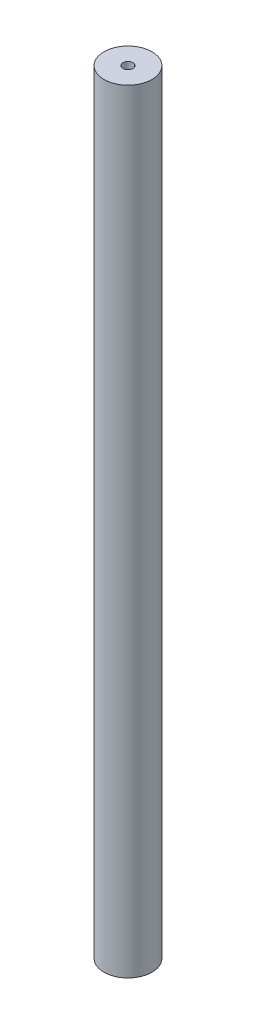
ISO-10303-21;
HEADER;
FILE_DESCRIPTION(('STEP AP214'),'2;1');
FILE_NAME('part.step','',(''),(''),'','','');
FILE_SCHEMA(('AUTOMOTIVE_DESIGN { 1 0 10303 214 1 1 1 1 }'));
ENDSEC;
DATA;
#1=APPLICATION_CONTEXT('core data for automotive mechanical design processes');
#2=APPLICATION_PROTOCOL_DEFINITION('international standard','automotive_design',2000,#1);
#3=PRODUCT_CONTEXT('',#1,'mechanical');
#4=PRODUCT('Part','Part','',(#3));
#5=PRODUCT_RELATED_PRODUCT_CATEGORY('part','',(#4));
#6=PRODUCT_DEFINITION_FORMATION('','',#4);
#7=PRODUCT_DEFINITION_CONTEXT('part definition',#1,'design');
#8=PRODUCT_DEFINITION('design','',#6,#7);
#9=PRODUCT_DEFINITION_SHAPE('','',#8);
#10=(LENGTH_UNIT() NAMED_UNIT(*) SI_UNIT(.MILLI.,.METRE.));
#11=(NAMED_UNIT(*) PLANE_ANGLE_UNIT() SI_UNIT($,.RADIAN.));
#12=(NAMED_UNIT(*) SI_UNIT($,.STERADIAN.) SOLID_ANGLE_UNIT());
#13=UNCERTAINTY_MEASURE_WITH_UNIT(LENGTH_MEASURE(1.E-05),#10,'distance_accuracy_value','');
#14=(GEOMETRIC_REPRESENTATION_CONTEXT(3) GLOBAL_UNCERTAINTY_ASSIGNED_CONTEXT((#13)) GLOBAL_UNIT_ASSIGNED_CONTEXT((#10,
#11,#12)) REPRESENTATION_CONTEXT('',''));
#15=CARTESIAN_POINT('',(0.,0.,0.));
#16=DIRECTION('',(0.,0.,1.));
#17=DIRECTION('',(1.,0.,0.));
#18=AXIS2_PLACEMENT_3D('',#15,#16,#17);
#19=CARTESIAN_POINT('',(0.,161.1,0.));
#20=DIRECTION('',(0.,-1.,0.));
#21=DIRECTION('',(0.,0.,-1.));
#22=AXIS2_PLACEMENT_3D('',#19,#20,#21);
#23=CYLINDRICAL_SURFACE('',#22,10.);
#24=CARTESIAN_POINT('',(0.,161.1,0.));
#25=DIRECTION('',(0.,1.,0.));
#26=DIRECTION('',(0.,0.,1.));
#27=AXIS2_PLACEMENT_3D('',#24,#25,#26);
#28=CIRCLE('',#27,10.);
#29=CARTESIAN_POINT('',(0.,161.1,10.));
#30=VERTEX_POINT('',#29);
#31=EDGE_CURVE('E11',#30,#30,#28,.T.);
#32=ORIENTED_EDGE('',*,*,#31,.F.);
#33=EDGE_LOOP('',(#32));
#34=FACE_BOUND('',#33,.T.);
#35=CARTESIAN_POINT('',(0.,-161.1,0.));
#36=DIRECTION('',(0.,1.,0.));
#37=DIRECTION('',(0.,0.,1.));
#38=AXIS2_PLACEMENT_3D('',#35,#36,#37);
#39=CIRCLE('',#38,10.);
#40=CARTESIAN_POINT('',(0.,-161.1,10.));
#41=VERTEX_POINT('',#40);
#42=EDGE_CURVE('E40',#41,#41,#39,.T.);
#43=ORIENTED_EDGE('',*,*,#42,.T.);
#44=EDGE_LOOP('',(#43));
#45=FACE_BOUND('',#44,.T.);
#46=ADVANCED_FACE('F37',(#34,#45),#23,.T.);
#47=CARTESIAN_POINT('',(0.,161.1,0.));
#48=DIRECTION('',(0.,1.,0.));
#49=DIRECTION('',(0.,0.,1.));
#50=AXIS2_PLACEMENT_3D('',#47,#48,#49);
#51=PLANE('',#50);
#52=CARTESIAN_POINT('',(0.,161.1,0.));
#53=DIRECTION('',(0.,1.,0.));
#54=DIRECTION('',(0.,0.,1.));
#55=AXIS2_PLACEMENT_3D('',#52,#53,#54);
#56=CIRCLE('',#55,2.1);
#57=CARTESIAN_POINT('',(0.,161.1,2.1));
#58=VERTEX_POINT('',#57);
#59=EDGE_CURVE('E60',#58,#58,#56,.T.);
#60=ORIENTED_EDGE('',*,*,#59,.F.);
#61=EDGE_LOOP('',(#60));
#62=FACE_BOUND('',#61,.T.);
#63=ORIENTED_EDGE('',*,*,#31,.T.);
#64=EDGE_LOOP('',(#63));
#65=FACE_BOUND('',#64,.T.);
#66=ADVANCED_FACE('F79',(#62,#65),#51,.T.);
#67=CARTESIAN_POINT('',(0.,-161.1,0.));
#68=DIRECTION('',(0.,1.,0.));
#69=DIRECTION('',(0.,0.,1.));
#70=AXIS2_PLACEMENT_3D('',#67,#68,#69);
#71=PLANE('',#70);
#72=CARTESIAN_POINT('',(0.,-161.1,0.));
#73=DIRECTION('',(0.,-1.,0.));
#74=DIRECTION('',(0.,0.,-1.));
#75=AXIS2_PLACEMENT_3D('',#72,#73,#74);
#76=CIRCLE('',#75,2.1);
#77=CARTESIAN_POINT('',(0.,-161.1,-2.1));
#78=VERTEX_POINT('',#77);
#79=EDGE_CURVE('E61',#78,#78,#76,.T.);
#80=ORIENTED_EDGE('',*,*,#79,.F.);
#81=EDGE_LOOP('',(#80));
#82=FACE_BOUND('',#81,.T.);
#83=ORIENTED_EDGE('',*,*,#42,.F.);
#84=EDGE_LOOP('',(#83));
#85=FACE_BOUND('',#84,.T.);
#86=ADVANCED_FACE('F76',(#82,#85),#71,.F.);
#87=CARTESIAN_POINT('',(0.,138.6,0.));
#88=DIRECTION('',(0.,1.,0.));
#89=DIRECTION('',(0.,0.,1.));
#90=AXIS2_PLACEMENT_3D('',#87,#88,#89);
#91=CONICAL_SURFACE('',#90,2.1,1.02974425867665);
#92=CARTESIAN_POINT('',(0.,137.338192700042,0.));
#93=VERTEX_POINT('',#92);
#94=VERTEX_LOOP('',#93);
#95=FACE_BOUND('',#94,.T.);
#96=CARTESIAN_POINT('',(0.,138.6,0.));
#97=DIRECTION('',(0.,1.,0.));
#98=DIRECTION('',(0.,0.,1.));
#99=AXIS2_PLACEMENT_3D('',#96,#97,#98);
#100=CIRCLE('',#99,2.1);
#101=CARTESIAN_POINT('',(0.,138.6,2.1));
#102=VERTEX_POINT('',#101);
#103=EDGE_CURVE('E64',#102,#102,#100,.T.);
#104=ORIENTED_EDGE('',*,*,#103,.T.);
#105=EDGE_LOOP('',(#104));
#106=FACE_BOUND('',#105,.T.);
#107=ADVANCED_FACE('F78',(#95,#106),#91,.F.);
#108=CARTESIAN_POINT('',(0.,161.1,0.));
#109=DIRECTION('',(0.,1.,0.));
#110=DIRECTION('',(0.,0.,1.));
#111=AXIS2_PLACEMENT_3D('',#108,#109,#110);
#112=CYLINDRICAL_SURFACE('',#111,2.1);
#113=ORIENTED_EDGE('',*,*,#103,.F.);
#114=EDGE_LOOP('',(#113));
#115=FACE_BOUND('',#114,.T.);
#116=ORIENTED_EDGE('',*,*,#59,.T.);
#117=EDGE_LOOP('',(#116));
#118=FACE_BOUND('',#117,.T.);
#119=ADVANCED_FACE('F54',(#115,#118),#112,.F.);
#120=CARTESIAN_POINT('',(0.,-138.6,0.));
#121=DIRECTION('',(0.,-1.,0.));
#122=DIRECTION('',(0.,0.,-1.));
#123=AXIS2_PLACEMENT_3D('',#120,#121,#122);
#124=CONICAL_SURFACE('',#123,2.1,1.02974425867665);
#125=CARTESIAN_POINT('',(0.,-137.338192700042,0.));
#126=VERTEX_POINT('',#125);
#127=VERTEX_LOOP('',#126);
#128=FACE_BOUND('',#127,.T.);
#129=CARTESIAN_POINT('',(0.,-138.6,0.));
#130=DIRECTION('',(0.,-1.,0.));
#131=DIRECTION('',(0.,0.,-1.));
#132=AXIS2_PLACEMENT_3D('',#129,#130,#131);
#133=CIRCLE('',#132,2.1);
#134=CARTESIAN_POINT('',(0.,-138.6,-2.1));
#135=VERTEX_POINT('',#134);
#136=EDGE_CURVE('E58',#135,#135,#133,.T.);
#137=ORIENTED_EDGE('',*,*,#136,.T.);
#138=EDGE_LOOP('',(#137));
#139=FACE_BOUND('',#138,.T.);
#140=ADVANCED_FACE('F50',(#128,#139),#124,.F.);
#141=CARTESIAN_POINT('',(0.,-161.1,0.));
#142=DIRECTION('',(0.,-1.,0.));
#143=DIRECTION('',(0.,0.,-1.));
#144=AXIS2_PLACEMENT_3D('',#141,#142,#143);
#145=CYLINDRICAL_SURFACE('',#144,2.1);
#146=ORIENTED_EDGE('',*,*,#136,.F.);
#147=EDGE_LOOP('',(#146));
#148=FACE_BOUND('',#147,.T.);
#149=ORIENTED_EDGE('',*,*,#79,.T.);
#150=EDGE_LOOP('',(#149));
#151=FACE_BOUND('',#150,.T.);
#152=ADVANCED_FACE('F53',(#148,#151),#145,.F.);
#153=CLOSED_SHELL('',(#46,#66,#86,#107,#119,#140,#152));
#154=MANIFOLD_SOLID_BREP('B2',#153);
#155=ADVANCED_BREP_SHAPE_REPRESENTATION('',(#18,#154),#14);
#156=SHAPE_DEFINITION_REPRESENTATION(#9,#155);
ENDSEC;
END-ISO-10303-21;
